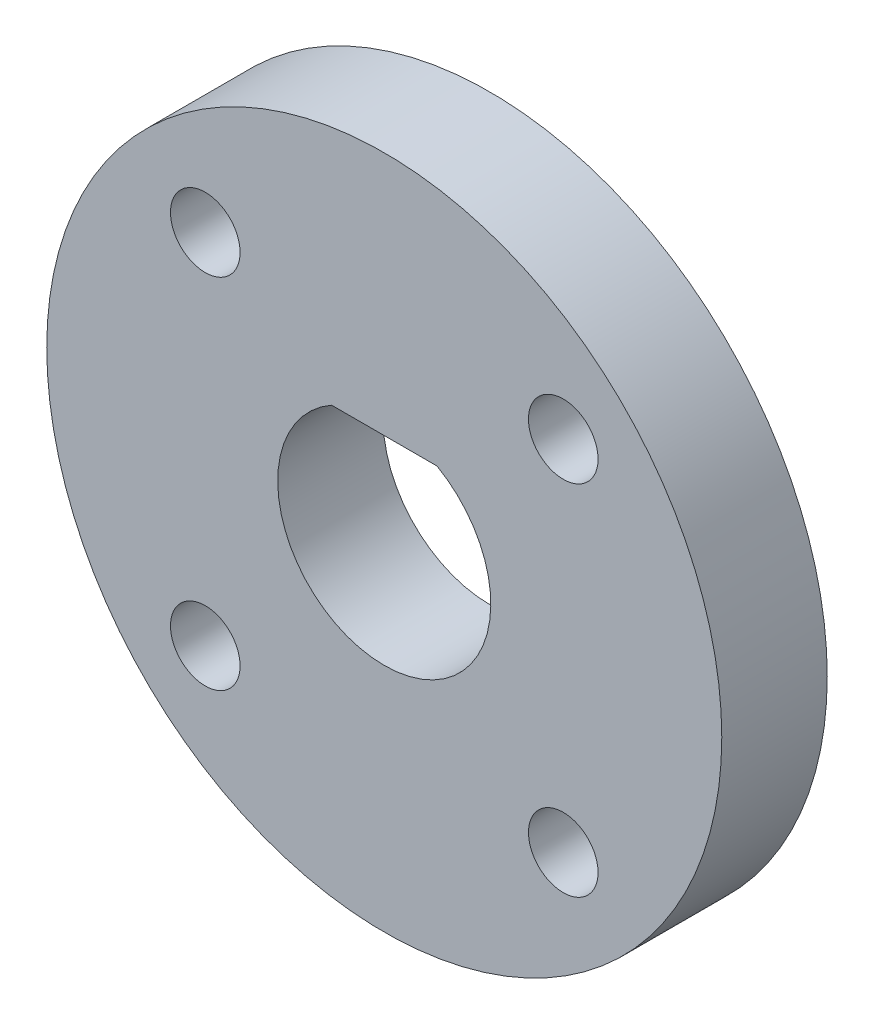
ISO-10303-21;
HEADER;
FILE_DESCRIPTION(('STEP AP214'),'2;1');
FILE_NAME('part.step','',(''),(''),'','','');
FILE_SCHEMA(('AUTOMOTIVE_DESIGN { 1 0 10303 214 1 1 1 1 }'));
ENDSEC;
DATA;
#1=APPLICATION_CONTEXT('core data for automotive mechanical design processes');
#2=APPLICATION_PROTOCOL_DEFINITION('international standard','automotive_design',2000,#1);
#3=PRODUCT_CONTEXT('',#1,'mechanical');
#4=PRODUCT('Part','Part','',(#3));
#5=PRODUCT_RELATED_PRODUCT_CATEGORY('part','',(#4));
#6=PRODUCT_DEFINITION_FORMATION('','',#4);
#7=PRODUCT_DEFINITION_CONTEXT('part definition',#1,'design');
#8=PRODUCT_DEFINITION('design','',#6,#7);
#9=PRODUCT_DEFINITION_SHAPE('','',#8);
#10=(LENGTH_UNIT() NAMED_UNIT(*) SI_UNIT(.MILLI.,.METRE.));
#11=(NAMED_UNIT(*) PLANE_ANGLE_UNIT() SI_UNIT($,.RADIAN.));
#12=(NAMED_UNIT(*) SI_UNIT($,.STERADIAN.) SOLID_ANGLE_UNIT());
#13=UNCERTAINTY_MEASURE_WITH_UNIT(LENGTH_MEASURE(1.E-05),#10,'distance_accuracy_value','');
#14=(GEOMETRIC_REPRESENTATION_CONTEXT(3) GLOBAL_UNCERTAINTY_ASSIGNED_CONTEXT((#13)) GLOBAL_UNIT_ASSIGNED_CONTEXT((#10,
#11,#12)) REPRESENTATION_CONTEXT('',''));
#15=CARTESIAN_POINT('',(0.,0.,0.));
#16=DIRECTION('',(0.,0.,1.));
#17=DIRECTION('',(1.,0.,0.));
#18=AXIS2_PLACEMENT_3D('',#15,#16,#17);
#19=CARTESIAN_POINT('',(0.,0.,-2.5));
#20=DIRECTION('',(0.,0.,1.));
#21=DIRECTION('',(-1.,0.,0.));
#22=AXIS2_PLACEMENT_3D('',#19,#20,#21);
#23=CYLINDRICAL_SURFACE('',#22,5.05);
#24=CARTESIAN_POINT('',(0.,0.,2.5));
#25=DIRECTION('',(0.,0.,1.));
#26=DIRECTION('',(1.,0.,0.));
#27=AXIS2_PLACEMENT_3D('',#24,#25,#26);
#28=CIRCLE('',#27,5.05);
#29=CARTESIAN_POINT('',(-2.5,4.38776708588776,2.5));
#30=VERTEX_POINT('',#29);
#31=CARTESIAN_POINT('',(2.5,4.38776708588776,2.5));
#32=VERTEX_POINT('',#31);
#33=EDGE_CURVE('E76',#30,#32,#28,.T.);
#34=ORIENTED_EDGE('',*,*,#33,.T.);
#35=DIRECTION('',(0.,0.,1.));
#36=VECTOR('',#35,1.);
#37=CARTESIAN_POINT('',(2.5,4.38776708588776,-2.5));
#38=LINE('',#37,#36);
#39=CARTESIAN_POINT('',(2.5,4.38776708588776,-2.5));
#40=VERTEX_POINT('',#39);
#41=EDGE_CURVE('E56',#40,#32,#38,.T.);
#42=ORIENTED_EDGE('',*,*,#41,.F.);
#43=CARTESIAN_POINT('',(0.,0.,-2.5));
#44=DIRECTION('',(0.,0.,1.));
#45=DIRECTION('',(1.,0.,0.));
#46=AXIS2_PLACEMENT_3D('',#43,#44,#45);
#47=CIRCLE('',#46,5.05);
#48=CARTESIAN_POINT('',(-2.5,4.38776708588776,-2.5));
#49=VERTEX_POINT('',#48);
#50=EDGE_CURVE('E93',#49,#40,#47,.T.);
#51=ORIENTED_EDGE('',*,*,#50,.F.);
#52=DIRECTION('',(0.,0.,1.));
#53=VECTOR('',#52,1.);
#54=CARTESIAN_POINT('',(-2.5,4.38776708588776,-2.5));
#55=LINE('',#54,#53);
#56=EDGE_CURVE('E12',#49,#30,#55,.T.);
#57=ORIENTED_EDGE('',*,*,#56,.T.);
#58=EDGE_LOOP('',(#34,#42,#51,#57));
#59=FACE_BOUND('',#58,.T.);
#60=ADVANCED_FACE('F48',(#59),#23,.F.);
#61=CARTESIAN_POINT('',(0.,4.38776708588776,-2.5));
#62=DIRECTION('',(0.,1.,0.));
#63=DIRECTION('',(0.,0.,-1.));
#64=AXIS2_PLACEMENT_3D('',#61,#62,#63);
#65=PLANE('',#64);
#66=DIRECTION('',(1.,0.,0.));
#67=VECTOR('',#66,1.);
#68=CARTESIAN_POINT('',(0.,4.38776708588776,2.5));
#69=LINE('',#68,#67);
#70=EDGE_CURVE('E70',#30,#32,#69,.T.);
#71=ORIENTED_EDGE('',*,*,#70,.F.);
#72=ORIENTED_EDGE('',*,*,#56,.F.);
#73=DIRECTION('',(1.,0.,0.));
#74=VECTOR('',#73,1.);
#75=CARTESIAN_POINT('',(0.,4.38776708588776,-2.5));
#76=LINE('',#75,#74);
#77=EDGE_CURVE('E64',#49,#40,#76,.T.);
#78=ORIENTED_EDGE('',*,*,#77,.T.);
#79=ORIENTED_EDGE('',*,*,#41,.T.);
#80=EDGE_LOOP('',(#71,#72,#78,#79));
#81=FACE_BOUND('',#80,.T.);
#82=ADVANCED_FACE('F80',(#81),#65,.F.);
#83=CARTESIAN_POINT('',(0.,0.,-2.5));
#84=DIRECTION('',(0.,0.,1.));
#85=DIRECTION('',(-1.,0.,0.));
#86=AXIS2_PLACEMENT_3D('',#83,#84,#85);
#87=CYLINDRICAL_SURFACE('',#86,16.);
#88=CARTESIAN_POINT('',(0.,0.,-2.5));
#89=DIRECTION('',(0.,0.,1.));
#90=DIRECTION('',(1.,0.,0.));
#91=AXIS2_PLACEMENT_3D('',#88,#89,#90);
#92=CIRCLE('',#91,16.);
#93=CARTESIAN_POINT('',(16.,0.,-2.5));
#94=VERTEX_POINT('',#93);
#95=EDGE_CURVE('E83',#94,#94,#92,.T.);
#96=ORIENTED_EDGE('',*,*,#95,.T.);
#97=EDGE_LOOP('',(#96));
#98=FACE_BOUND('',#97,.T.);
#99=CARTESIAN_POINT('',(0.,0.,2.5));
#100=DIRECTION('',(0.,0.,1.));
#101=DIRECTION('',(1.,0.,0.));
#102=AXIS2_PLACEMENT_3D('',#99,#100,#101);
#103=CIRCLE('',#102,16.);
#104=CARTESIAN_POINT('',(16.,0.,2.5));
#105=VERTEX_POINT('',#104);
#106=EDGE_CURVE('E77',#105,#105,#103,.T.);
#107=ORIENTED_EDGE('',*,*,#106,.F.);
#108=EDGE_LOOP('',(#107));
#109=FACE_BOUND('',#108,.T.);
#110=ADVANCED_FACE('F153',(#98,#109),#87,.T.);
#111=CARTESIAN_POINT('',(0.,0.,-2.5));
#112=DIRECTION('',(0.,0.,-1.));
#113=DIRECTION('',(1.,0.,0.));
#114=AXIS2_PLACEMENT_3D('',#111,#112,#113);
#115=PLANE('',#114);
#116=CARTESIAN_POINT('',(8.48528137423858,8.48528137423856,-2.5));
#117=DIRECTION('',(0.,0.,1.));
#118=DIRECTION('',(1.,0.,0.));
#119=AXIS2_PLACEMENT_3D('',#116,#117,#118);
#120=CIRCLE('',#119,1.65);
#121=CARTESIAN_POINT('',(10.1352813742386,8.48528137423856,-2.5));
#122=VERTEX_POINT('',#121);
#123=EDGE_CURVE('E124',#122,#122,#120,.T.);
#124=ORIENTED_EDGE('',*,*,#123,.T.);
#125=EDGE_LOOP('',(#124));
#126=FACE_BOUND('',#125,.T.);
#127=CARTESIAN_POINT('',(-8.48528137423856,8.48528137423858,-2.5));
#128=DIRECTION('',(0.,0.,1.));
#129=DIRECTION('',(1.,0.,0.));
#130=AXIS2_PLACEMENT_3D('',#127,#128,#129);
#131=CIRCLE('',#130,1.65);
#132=CARTESIAN_POINT('',(-6.83528137423856,8.48528137423858,-2.5));
#133=VERTEX_POINT('',#132);
#134=EDGE_CURVE('E117',#133,#133,#131,.T.);
#135=ORIENTED_EDGE('',*,*,#134,.T.);
#136=EDGE_LOOP('',(#135));
#137=FACE_BOUND('',#136,.T.);
#138=CARTESIAN_POINT('',(-8.48528137423859,-8.48528137423856,-2.5));
#139=DIRECTION('',(0.,0.,1.));
#140=DIRECTION('',(1.,0.,0.));
#141=AXIS2_PLACEMENT_3D('',#138,#139,#140);
#142=CIRCLE('',#141,1.65);
#143=CARTESIAN_POINT('',(-6.83528137423859,-8.48528137423856,-2.5));
#144=VERTEX_POINT('',#143);
#145=EDGE_CURVE('E110',#144,#144,#142,.T.);
#146=ORIENTED_EDGE('',*,*,#145,.T.);
#147=EDGE_LOOP('',(#146));
#148=FACE_BOUND('',#147,.T.);
#149=CARTESIAN_POINT('',(8.48528137423856,-8.48528137423859,-2.5));
#150=DIRECTION('',(0.,0.,1.));
#151=DIRECTION('',(1.,0.,0.));
#152=AXIS2_PLACEMENT_3D('',#149,#150,#151);
#153=CIRCLE('',#152,1.65);
#154=CARTESIAN_POINT('',(10.1352813742386,-8.48528137423859,-2.5));
#155=VERTEX_POINT('',#154);
#156=EDGE_CURVE('E87',#155,#155,#153,.T.);
#157=ORIENTED_EDGE('',*,*,#156,.T.);
#158=EDGE_LOOP('',(#157));
#159=FACE_BOUND('',#158,.T.);
#160=ORIENTED_EDGE('',*,*,#50,.T.);
#161=ORIENTED_EDGE('',*,*,#77,.F.);
#162=EDGE_LOOP('',(#160,#161));
#163=FACE_BOUND('',#162,.T.);
#164=ORIENTED_EDGE('',*,*,#95,.F.);
#165=EDGE_LOOP('',(#164));
#166=FACE_BOUND('',#165,.T.);
#167=ADVANCED_FACE('F138',(#126,#137,#148,#159,#163,#166),#115,.T.);
#168=CARTESIAN_POINT('',(0.,0.,2.5));
#169=DIRECTION('',(0.,0.,-1.));
#170=DIRECTION('',(1.,0.,0.));
#171=AXIS2_PLACEMENT_3D('',#168,#169,#170);
#172=PLANE('',#171);
#173=CARTESIAN_POINT('',(8.48528137423858,8.48528137423856,2.5));
#174=DIRECTION('',(0.,0.,1.));
#175=DIRECTION('',(1.,0.,0.));
#176=AXIS2_PLACEMENT_3D('',#173,#174,#175);
#177=CIRCLE('',#176,1.65);
#178=CARTESIAN_POINT('',(10.1352813742386,8.48528137423856,2.5));
#179=VERTEX_POINT('',#178);
#180=EDGE_CURVE('E121',#179,#179,#177,.T.);
#181=ORIENTED_EDGE('',*,*,#180,.F.);
#182=EDGE_LOOP('',(#181));
#183=FACE_BOUND('',#182,.T.);
#184=CARTESIAN_POINT('',(-8.48528137423856,8.48528137423858,2.5));
#185=DIRECTION('',(0.,0.,1.));
#186=DIRECTION('',(1.,0.,0.));
#187=AXIS2_PLACEMENT_3D('',#184,#185,#186);
#188=CIRCLE('',#187,1.65);
#189=CARTESIAN_POINT('',(-6.83528137423856,8.48528137423858,2.5));
#190=VERTEX_POINT('',#189);
#191=EDGE_CURVE('E114',#190,#190,#188,.T.);
#192=ORIENTED_EDGE('',*,*,#191,.F.);
#193=EDGE_LOOP('',(#192));
#194=FACE_BOUND('',#193,.T.);
#195=CARTESIAN_POINT('',(-8.48528137423859,-8.48528137423856,2.5));
#196=DIRECTION('',(0.,0.,1.));
#197=DIRECTION('',(1.,0.,0.));
#198=AXIS2_PLACEMENT_3D('',#195,#196,#197);
#199=CIRCLE('',#198,1.65);
#200=CARTESIAN_POINT('',(-6.83528137423859,-8.48528137423856,2.5));
#201=VERTEX_POINT('',#200);
#202=EDGE_CURVE('E108',#201,#201,#199,.T.);
#203=ORIENTED_EDGE('',*,*,#202,.F.);
#204=EDGE_LOOP('',(#203));
#205=FACE_BOUND('',#204,.T.);
#206=CARTESIAN_POINT('',(8.48528137423856,-8.48528137423859,2.5));
#207=DIRECTION('',(0.,0.,1.));
#208=DIRECTION('',(1.,0.,0.));
#209=AXIS2_PLACEMENT_3D('',#206,#207,#208);
#210=CIRCLE('',#209,1.65);
#211=CARTESIAN_POINT('',(10.1352813742386,-8.48528137423859,2.5));
#212=VERTEX_POINT('',#211);
#213=EDGE_CURVE('E84',#212,#212,#210,.T.);
#214=ORIENTED_EDGE('',*,*,#213,.F.);
#215=EDGE_LOOP('',(#214));
#216=FACE_BOUND('',#215,.T.);
#217=ORIENTED_EDGE('',*,*,#33,.F.);
#218=ORIENTED_EDGE('',*,*,#70,.T.);
#219=EDGE_LOOP('',(#217,#218));
#220=FACE_BOUND('',#219,.T.);
#221=ORIENTED_EDGE('',*,*,#106,.T.);
#222=EDGE_LOOP('',(#221));
#223=FACE_BOUND('',#222,.T.);
#224=ADVANCED_FACE('F73',(#183,#194,#205,#216,#220,#223),#172,.F.);
#225=CARTESIAN_POINT('',(8.48528137423856,-8.48528137423859,-2.5));
#226=DIRECTION('',(0.,0.,-1.));
#227=DIRECTION('',(1.,0.,0.));
#228=AXIS2_PLACEMENT_3D('',#225,#226,#227);
#229=CYLINDRICAL_SURFACE('',#228,1.65);
#230=ORIENTED_EDGE('',*,*,#213,.T.);
#231=EDGE_LOOP('',(#230));
#232=FACE_BOUND('',#231,.T.);
#233=ORIENTED_EDGE('',*,*,#156,.F.);
#234=EDGE_LOOP('',(#233));
#235=FACE_BOUND('',#234,.T.);
#236=ADVANCED_FACE('F137',(#232,#235),#229,.F.);
#237=CARTESIAN_POINT('',(-8.48528137423859,-8.48528137423856,-2.5));
#238=DIRECTION('',(0.,0.,-1.));
#239=DIRECTION('',(1.,0.,0.));
#240=AXIS2_PLACEMENT_3D('',#237,#238,#239);
#241=CYLINDRICAL_SURFACE('',#240,1.65);
#242=ORIENTED_EDGE('',*,*,#202,.T.);
#243=EDGE_LOOP('',(#242));
#244=FACE_BOUND('',#243,.T.);
#245=ORIENTED_EDGE('',*,*,#145,.F.);
#246=EDGE_LOOP('',(#245));
#247=FACE_BOUND('',#246,.T.);
#248=ADVANCED_FACE('F148',(#244,#247),#241,.F.);
#249=CARTESIAN_POINT('',(-8.48528137423856,8.48528137423858,-2.5));
#250=DIRECTION('',(0.,0.,-1.));
#251=DIRECTION('',(1.,0.,0.));
#252=AXIS2_PLACEMENT_3D('',#249,#250,#251);
#253=CYLINDRICAL_SURFACE('',#252,1.65);
#254=ORIENTED_EDGE('',*,*,#191,.T.);
#255=EDGE_LOOP('',(#254));
#256=FACE_BOUND('',#255,.T.);
#257=ORIENTED_EDGE('',*,*,#134,.F.);
#258=EDGE_LOOP('',(#257));
#259=FACE_BOUND('',#258,.T.);
#260=ADVANCED_FACE('F211',(#256,#259),#253,.F.);
#261=CARTESIAN_POINT('',(8.48528137423858,8.48528137423856,-2.5));
#262=DIRECTION('',(0.,0.,-1.));
#263=DIRECTION('',(1.,0.,0.));
#264=AXIS2_PLACEMENT_3D('',#261,#262,#263);
#265=CYLINDRICAL_SURFACE('',#264,1.65);
#266=ORIENTED_EDGE('',*,*,#180,.T.);
#267=EDGE_LOOP('',(#266));
#268=FACE_BOUND('',#267,.T.);
#269=ORIENTED_EDGE('',*,*,#123,.F.);
#270=EDGE_LOOP('',(#269));
#271=FACE_BOUND('',#270,.T.);
#272=ADVANCED_FACE('F132',(#268,#271),#265,.F.);
#273=CLOSED_SHELL('',(#60,#82,#110,#167,#224,#236,#248,#260,#272));
#274=MANIFOLD_SOLID_BREP('B2',#273);
#275=ADVANCED_BREP_SHAPE_REPRESENTATION('',(#18,#274),#14);
#276=SHAPE_DEFINITION_REPRESENTATION(#9,#275);
ENDSEC;
END-ISO-10303-21;
